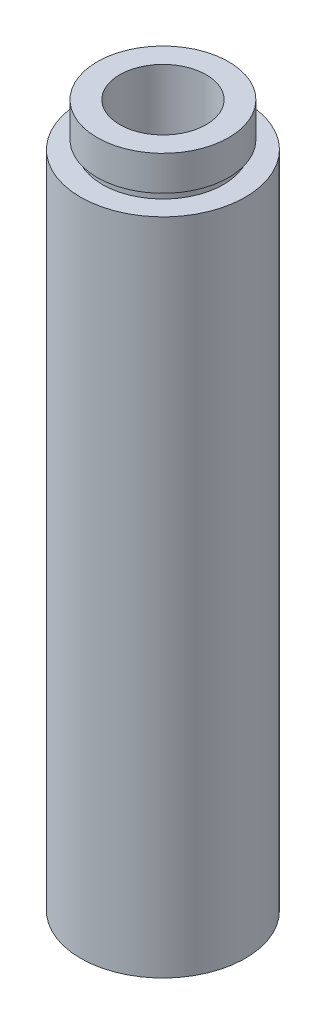
ISO-10303-21;
HEADER;
FILE_DESCRIPTION(('STEP AP214'),'2;1');
FILE_NAME('part.step','',(''),(''),'','','');
FILE_SCHEMA(('AUTOMOTIVE_DESIGN { 1 0 10303 214 1 1 1 1 }'));
ENDSEC;
DATA;
#1=APPLICATION_CONTEXT('core data for automotive mechanical design processes');
#2=APPLICATION_PROTOCOL_DEFINITION('international standard','automotive_design',2000,#1);
#3=PRODUCT_CONTEXT('',#1,'mechanical');
#4=PRODUCT('Part','Part','',(#3));
#5=PRODUCT_RELATED_PRODUCT_CATEGORY('part','',(#4));
#6=PRODUCT_DEFINITION_FORMATION('','',#4);
#7=PRODUCT_DEFINITION_CONTEXT('part definition',#1,'design');
#8=PRODUCT_DEFINITION('design','',#6,#7);
#9=PRODUCT_DEFINITION_SHAPE('','',#8);
#10=(LENGTH_UNIT() NAMED_UNIT(*) SI_UNIT(.MILLI.,.METRE.));
#11=(NAMED_UNIT(*) PLANE_ANGLE_UNIT() SI_UNIT($,.RADIAN.));
#12=(NAMED_UNIT(*) SI_UNIT($,.STERADIAN.) SOLID_ANGLE_UNIT());
#13=UNCERTAINTY_MEASURE_WITH_UNIT(LENGTH_MEASURE(1.E-05),#10,'distance_accuracy_value','');
#14=(GEOMETRIC_REPRESENTATION_CONTEXT(3) GLOBAL_UNCERTAINTY_ASSIGNED_CONTEXT((#13)) GLOBAL_UNIT_ASSIGNED_CONTEXT((#10,
#11,#12)) REPRESENTATION_CONTEXT('',''));
#15=CARTESIAN_POINT('',(0.,0.,0.));
#16=DIRECTION('',(0.,0.,1.));
#17=DIRECTION('',(1.,0.,0.));
#18=AXIS2_PLACEMENT_3D('',#15,#16,#17);
#19=CARTESIAN_POINT('',(7.00000000000002,0.,0.));
#20=DIRECTION('',(0.,1.,0.));
#21=DIRECTION('',(0.,0.,1.));
#22=AXIS2_PLACEMENT_3D('',#19,#20,#21);
#23=PLANE('',#22);
#24=CARTESIAN_POINT('',(0.,0.,0.));
#25=DIRECTION('',(0.,1.,0.));
#26=DIRECTION('',(0.,0.,1.));
#27=AXIS2_PLACEMENT_3D('',#24,#25,#26);
#28=CIRCLE('',#27,9.52500000000002);
#29=CARTESIAN_POINT('',(0.,0.,9.52500000000002));
#30=VERTEX_POINT('',#29);
#31=EDGE_CURVE('E10',#30,#30,#28,.T.);
#32=ORIENTED_EDGE('',*,*,#31,.F.);
#33=EDGE_LOOP('',(#32));
#34=FACE_BOUND('',#33,.T.);
#35=CARTESIAN_POINT('',(0.,0.,0.));
#36=DIRECTION('',(0.,1.,0.));
#37=DIRECTION('',(0.,0.,1.));
#38=AXIS2_PLACEMENT_3D('',#35,#36,#37);
#39=CIRCLE('',#38,7.00000000000002);
#40=CARTESIAN_POINT('',(0.,0.,7.00000000000002));
#41=VERTEX_POINT('',#40);
#42=EDGE_CURVE('E77',#41,#41,#39,.T.);
#43=ORIENTED_EDGE('',*,*,#42,.T.);
#44=EDGE_LOOP('',(#43));
#45=FACE_BOUND('',#44,.T.);
#46=ADVANCED_FACE('F37',(#34,#45),#23,.F.);
#47=CARTESIAN_POINT('',(0.,161.376166943427,0.));
#48=DIRECTION('',(0.,1.,0.));
#49=DIRECTION('',(0.,0.,1.));
#50=AXIS2_PLACEMENT_3D('',#47,#48,#49);
#51=CYLINDRICAL_SURFACE('',#50,9.52500000000002);
#52=CARTESIAN_POINT('',(0.,76.2,0.));
#53=DIRECTION('',(0.,1.,0.));
#54=DIRECTION('',(0.,0.,1.));
#55=AXIS2_PLACEMENT_3D('',#52,#53,#54);
#56=CIRCLE('',#55,9.52500000000002);
#57=CARTESIAN_POINT('',(0.,76.2,9.52500000000002));
#58=VERTEX_POINT('',#57);
#59=EDGE_CURVE('E43',#58,#58,#56,.T.);
#60=ORIENTED_EDGE('',*,*,#59,.F.);
#61=EDGE_LOOP('',(#60));
#62=FACE_BOUND('',#61,.T.);
#63=ORIENTED_EDGE('',*,*,#31,.T.);
#64=EDGE_LOOP('',(#63));
#65=FACE_BOUND('',#64,.T.);
#66=ADVANCED_FACE('F138',(#62,#65),#51,.T.);
#67=CARTESIAN_POINT('',(9.52500000000002,76.2,0.));
#68=DIRECTION('',(0.,-1.,0.));
#69=DIRECTION('',(0.,0.,-1.));
#70=AXIS2_PLACEMENT_3D('',#67,#68,#69);
#71=PLANE('',#70);
#72=CARTESIAN_POINT('',(0.,76.2,0.));
#73=DIRECTION('',(0.,1.,0.));
#74=DIRECTION('',(0.,0.,1.));
#75=AXIS2_PLACEMENT_3D('',#72,#73,#74);
#76=CIRCLE('',#75,7.00000000000001);
#77=CARTESIAN_POINT('',(0.,76.2,7.00000000000001));
#78=VERTEX_POINT('',#77);
#79=EDGE_CURVE('E47',#78,#78,#76,.T.);
#80=ORIENTED_EDGE('',*,*,#79,.F.);
#81=EDGE_LOOP('',(#80));
#82=FACE_BOUND('',#81,.T.);
#83=ORIENTED_EDGE('',*,*,#59,.T.);
#84=EDGE_LOOP('',(#83));
#85=FACE_BOUND('',#84,.T.);
#86=ADVANCED_FACE('F133',(#82,#85),#71,.F.);
#87=CARTESIAN_POINT('',(0.,161.376166943427,0.));
#88=DIRECTION('',(0.,1.,0.));
#89=DIRECTION('',(0.,0.,1.));
#90=AXIS2_PLACEMENT_3D('',#87,#88,#89);
#91=CYLINDRICAL_SURFACE('',#90,7.00000000000001);
#92=CARTESIAN_POINT('',(0.,77.2,0.));
#93=DIRECTION('',(0.,1.,0.));
#94=DIRECTION('',(0.,0.,1.));
#95=AXIS2_PLACEMENT_3D('',#92,#93,#94);
#96=CIRCLE('',#95,7.00000000000001);
#97=CARTESIAN_POINT('',(0.,77.2,7.00000000000001));
#98=VERTEX_POINT('',#97);
#99=EDGE_CURVE('E51',#98,#98,#96,.T.);
#100=ORIENTED_EDGE('',*,*,#99,.F.);
#101=EDGE_LOOP('',(#100));
#102=FACE_BOUND('',#101,.T.);
#103=ORIENTED_EDGE('',*,*,#79,.T.);
#104=EDGE_LOOP('',(#103));
#105=FACE_BOUND('',#104,.T.);
#106=ADVANCED_FACE('F127',(#102,#105),#91,.T.);
#107=CARTESIAN_POINT('',(7.00000000000001,77.2,0.));
#108=DIRECTION('',(0.,1.,0.));
#109=DIRECTION('',(0.,0.,1.));
#110=AXIS2_PLACEMENT_3D('',#107,#108,#109);
#111=PLANE('',#110);
#112=CARTESIAN_POINT('',(0.,77.2,0.));
#113=DIRECTION('',(0.,1.,0.));
#114=DIRECTION('',(0.,0.,1.));
#115=AXIS2_PLACEMENT_3D('',#112,#113,#114);
#116=CIRCLE('',#115,7.60000000000001);
#117=CARTESIAN_POINT('',(0.,77.2,7.60000000000001));
#118=VERTEX_POINT('',#117);
#119=EDGE_CURVE('E56',#118,#118,#116,.T.);
#120=ORIENTED_EDGE('',*,*,#119,.F.);
#121=EDGE_LOOP('',(#120));
#122=FACE_BOUND('',#121,.T.);
#123=ORIENTED_EDGE('',*,*,#99,.T.);
#124=EDGE_LOOP('',(#123));
#125=FACE_BOUND('',#124,.T.);
#126=ADVANCED_FACE('F121',(#122,#125),#111,.F.);
#127=CARTESIAN_POINT('',(0.,161.376166943427,0.));
#128=DIRECTION('',(0.,1.,0.));
#129=DIRECTION('',(0.,0.,1.));
#130=AXIS2_PLACEMENT_3D('',#127,#128,#129);
#131=CYLINDRICAL_SURFACE('',#130,7.60000000000001);
#132=CARTESIAN_POINT('',(0.,81.2,0.));
#133=DIRECTION('',(0.,1.,0.));
#134=DIRECTION('',(0.,0.,1.));
#135=AXIS2_PLACEMENT_3D('',#132,#133,#134);
#136=CIRCLE('',#135,7.60000000000001);
#137=CARTESIAN_POINT('',(0.,81.2,7.60000000000001));
#138=VERTEX_POINT('',#137);
#139=EDGE_CURVE('E59',#138,#138,#136,.T.);
#140=ORIENTED_EDGE('',*,*,#139,.F.);
#141=EDGE_LOOP('',(#140));
#142=FACE_BOUND('',#141,.T.);
#143=ORIENTED_EDGE('',*,*,#119,.T.);
#144=EDGE_LOOP('',(#143));
#145=FACE_BOUND('',#144,.T.);
#146=ADVANCED_FACE('F115',(#142,#145),#131,.T.);
#147=CARTESIAN_POINT('',(7.60000000000001,81.2,0.));
#148=DIRECTION('',(0.,-1.,0.));
#149=DIRECTION('',(0.,0.,-1.));
#150=AXIS2_PLACEMENT_3D('',#147,#148,#149);
#151=PLANE('',#150);
#152=CARTESIAN_POINT('',(0.,81.2,0.));
#153=DIRECTION('',(0.,1.,0.));
#154=DIRECTION('',(0.,0.,1.));
#155=AXIS2_PLACEMENT_3D('',#152,#153,#154);
#156=CIRCLE('',#155,5.00000000000002);
#157=CARTESIAN_POINT('',(0.,81.2,5.00000000000002));
#158=VERTEX_POINT('',#157);
#159=EDGE_CURVE('E62',#158,#158,#156,.T.);
#160=ORIENTED_EDGE('',*,*,#159,.F.);
#161=EDGE_LOOP('',(#160));
#162=FACE_BOUND('',#161,.T.);
#163=ORIENTED_EDGE('',*,*,#139,.T.);
#164=EDGE_LOOP('',(#163));
#165=FACE_BOUND('',#164,.T.);
#166=ADVANCED_FACE('F109',(#162,#165),#151,.F.);
#167=CARTESIAN_POINT('',(0.,161.376166943427,0.));
#168=DIRECTION('',(0.,1.,0.));
#169=DIRECTION('',(0.,0.,1.));
#170=AXIS2_PLACEMENT_3D('',#167,#168,#169);
#171=CYLINDRICAL_SURFACE('',#170,5.00000000000002);
#172=CARTESIAN_POINT('',(0.,5.49999999999998,0.));
#173=DIRECTION('',(0.,1.,0.));
#174=DIRECTION('',(0.,0.,1.));
#175=AXIS2_PLACEMENT_3D('',#172,#173,#174);
#176=CIRCLE('',#175,5.00000000000002);
#177=CARTESIAN_POINT('',(0.,5.49999999999998,5.00000000000002));
#178=VERTEX_POINT('',#177);
#179=EDGE_CURVE('E65',#178,#178,#176,.T.);
#180=ORIENTED_EDGE('',*,*,#179,.F.);
#181=EDGE_LOOP('',(#180));
#182=FACE_BOUND('',#181,.T.);
#183=ORIENTED_EDGE('',*,*,#159,.T.);
#184=EDGE_LOOP('',(#183));
#185=FACE_BOUND('',#184,.T.);
#186=ADVANCED_FACE('F103',(#182,#185),#171,.F.);
#187=CARTESIAN_POINT('',(7.60000000000002,5.49999999999998,0.));
#188=DIRECTION('',(0.,1.,0.));
#189=DIRECTION('',(0.,0.,1.));
#190=AXIS2_PLACEMENT_3D('',#187,#188,#189);
#191=PLANE('',#190);
#192=CARTESIAN_POINT('',(0.,5.49999999999998,0.));
#193=DIRECTION('',(0.,1.,0.));
#194=DIRECTION('',(0.,0.,1.));
#195=AXIS2_PLACEMENT_3D('',#192,#193,#194);
#196=CIRCLE('',#195,7.60000000000002);
#197=CARTESIAN_POINT('',(0.,5.49999999999998,7.60000000000002));
#198=VERTEX_POINT('',#197);
#199=EDGE_CURVE('E68',#198,#198,#196,.T.);
#200=ORIENTED_EDGE('',*,*,#199,.F.);
#201=EDGE_LOOP('',(#200));
#202=FACE_BOUND('',#201,.T.);
#203=ORIENTED_EDGE('',*,*,#179,.T.);
#204=EDGE_LOOP('',(#203));
#205=FACE_BOUND('',#204,.T.);
#206=ADVANCED_FACE('F97',(#202,#205),#191,.F.);
#207=CARTESIAN_POINT('',(0.,161.376166943427,0.));
#208=DIRECTION('',(0.,1.,0.));
#209=DIRECTION('',(0.,0.,1.));
#210=AXIS2_PLACEMENT_3D('',#207,#208,#209);
#211=CYLINDRICAL_SURFACE('',#210,7.60000000000002);
#212=CARTESIAN_POINT('',(0.,4.49999999999998,0.));
#213=DIRECTION('',(0.,1.,0.));
#214=DIRECTION('',(0.,0.,1.));
#215=AXIS2_PLACEMENT_3D('',#212,#213,#214);
#216=CIRCLE('',#215,7.60000000000002);
#217=CARTESIAN_POINT('',(0.,4.49999999999998,7.60000000000002));
#218=VERTEX_POINT('',#217);
#219=EDGE_CURVE('E71',#218,#218,#216,.T.);
#220=ORIENTED_EDGE('',*,*,#219,.F.);
#221=EDGE_LOOP('',(#220));
#222=FACE_BOUND('',#221,.T.);
#223=ORIENTED_EDGE('',*,*,#199,.T.);
#224=EDGE_LOOP('',(#223));
#225=FACE_BOUND('',#224,.T.);
#226=ADVANCED_FACE('F91',(#222,#225),#211,.F.);
#227=CARTESIAN_POINT('',(7.00000000000002,4.49999999999998,0.));
#228=DIRECTION('',(0.,-1.,0.));
#229=DIRECTION('',(0.,0.,-1.));
#230=AXIS2_PLACEMENT_3D('',#227,#228,#229);
#231=PLANE('',#230);
#232=CARTESIAN_POINT('',(0.,4.49999999999998,0.));
#233=DIRECTION('',(0.,1.,0.));
#234=DIRECTION('',(0.,0.,1.));
#235=AXIS2_PLACEMENT_3D('',#232,#233,#234);
#236=CIRCLE('',#235,7.00000000000002);
#237=CARTESIAN_POINT('',(0.,4.49999999999998,7.00000000000002));
#238=VERTEX_POINT('',#237);
#239=EDGE_CURVE('E74',#238,#238,#236,.T.);
#240=ORIENTED_EDGE('',*,*,#239,.F.);
#241=EDGE_LOOP('',(#240));
#242=FACE_BOUND('',#241,.T.);
#243=ORIENTED_EDGE('',*,*,#219,.T.);
#244=EDGE_LOOP('',(#243));
#245=FACE_BOUND('',#244,.T.);
#246=ADVANCED_FACE('F85',(#242,#245),#231,.F.);
#247=CARTESIAN_POINT('',(0.,161.376166943427,0.));
#248=DIRECTION('',(0.,1.,0.));
#249=DIRECTION('',(0.,0.,1.));
#250=AXIS2_PLACEMENT_3D('',#247,#248,#249);
#251=CYLINDRICAL_SURFACE('',#250,7.00000000000002);
#252=ORIENTED_EDGE('',*,*,#42,.F.);
#253=EDGE_LOOP('',(#252));
#254=FACE_BOUND('',#253,.T.);
#255=ORIENTED_EDGE('',*,*,#239,.T.);
#256=EDGE_LOOP('',(#255));
#257=FACE_BOUND('',#256,.T.);
#258=ADVANCED_FACE('F82',(#254,#257),#251,.F.);
#259=CLOSED_SHELL('',(#46,#66,#86,#106,#126,#146,#166,#186,#206,#226,#246,#258));
#260=MANIFOLD_SOLID_BREP('B2',#259);
#261=ADVANCED_BREP_SHAPE_REPRESENTATION('',(#18,#260),#14);
#262=SHAPE_DEFINITION_REPRESENTATION(#9,#261);
ENDSEC;
END-ISO-10303-21;
